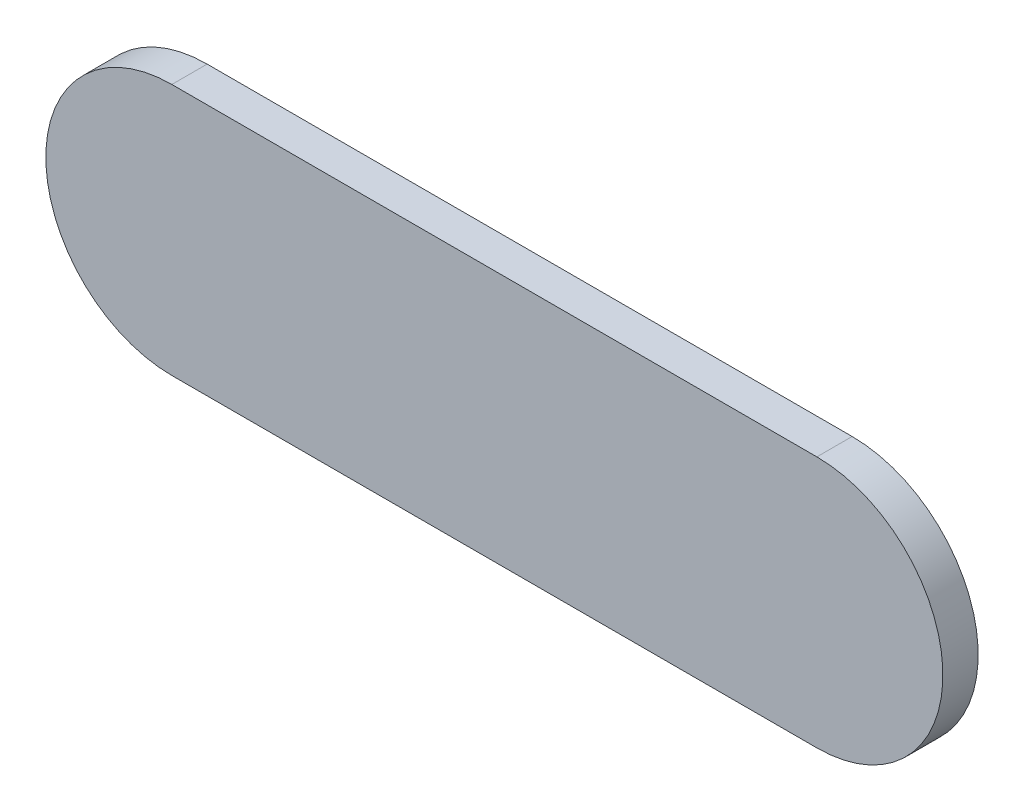
ISO-10303-21;
HEADER;
FILE_DESCRIPTION(('STEP AP214'),'2;1');
FILE_NAME('part.step','',(''),(''),'','','');
FILE_SCHEMA(('AUTOMOTIVE_DESIGN { 1 0 10303 214 1 1 1 1 }'));
ENDSEC;
DATA;
#1=APPLICATION_CONTEXT('core data for automotive mechanical design processes');
#2=APPLICATION_PROTOCOL_DEFINITION('international standard','automotive_design',2000,#1);
#3=PRODUCT_CONTEXT('',#1,'mechanical');
#4=PRODUCT('Part','Part','',(#3));
#5=PRODUCT_RELATED_PRODUCT_CATEGORY('part','',(#4));
#6=PRODUCT_DEFINITION_FORMATION('','',#4);
#7=PRODUCT_DEFINITION_CONTEXT('part definition',#1,'design');
#8=PRODUCT_DEFINITION('design','',#6,#7);
#9=PRODUCT_DEFINITION_SHAPE('','',#8);
#10=(LENGTH_UNIT() NAMED_UNIT(*) SI_UNIT(.MILLI.,.METRE.));
#11=(NAMED_UNIT(*) PLANE_ANGLE_UNIT() SI_UNIT($,.RADIAN.));
#12=(NAMED_UNIT(*) SI_UNIT($,.STERADIAN.) SOLID_ANGLE_UNIT());
#13=UNCERTAINTY_MEASURE_WITH_UNIT(LENGTH_MEASURE(1.E-05),#10,'distance_accuracy_value','');
#14=(GEOMETRIC_REPRESENTATION_CONTEXT(3) GLOBAL_UNCERTAINTY_ASSIGNED_CONTEXT((#13)) GLOBAL_UNIT_ASSIGNED_CONTEXT((#10,
#11,#12)) REPRESENTATION_CONTEXT('',''));
#15=CARTESIAN_POINT('',(0.,0.,0.));
#16=DIRECTION('',(0.,0.,1.));
#17=DIRECTION('',(1.,0.,0.));
#18=AXIS2_PLACEMENT_3D('',#15,#16,#17);
#19=CARTESIAN_POINT('',(99.3169972,84.0599538,0.));
#20=DIRECTION('',(0.,1.,0.));
#21=DIRECTION('',(1.,0.,0.));
#22=AXIS2_PLACEMENT_3D('',#19,#20,#21);
#23=PLANE('',#22);
#24=DIRECTION('',(1.,0.,0.));
#25=VECTOR('',#24,1.);
#26=CARTESIAN_POINT('',(99.3169972,84.0599538,0.03556));
#27=LINE('',#26,#25);
#28=CARTESIAN_POINT('',(99.3169972,84.0599538,0.03556));
#29=VERTEX_POINT('',#28);
#30=CARTESIAN_POINT('',(99.9669832,84.0599538,0.03556));
#31=VERTEX_POINT('',#30);
#32=EDGE_CURVE('E11',#29,#31,#27,.T.);
#33=ORIENTED_EDGE('',*,*,#32,.F.);
#34=DIRECTION('',(0.,0.,1.));
#35=VECTOR('',#34,1.);
#36=CARTESIAN_POINT('',(99.3169972,84.0599538,0.));
#37=LINE('',#36,#35);
#38=CARTESIAN_POINT('',(99.3169972,84.0599538,0.));
#39=VERTEX_POINT('',#38);
#40=EDGE_CURVE('E24',#39,#29,#37,.T.);
#41=ORIENTED_EDGE('',*,*,#40,.F.);
#42=DIRECTION('',(1.,0.,0.));
#43=VECTOR('',#42,1.);
#44=CARTESIAN_POINT('',(99.3169972,84.0599538,0.));
#45=LINE('',#44,#43);
#46=CARTESIAN_POINT('',(99.9669832,84.0599538,0.));
#47=VERTEX_POINT('',#46);
#48=EDGE_CURVE('E75',#39,#47,#45,.T.);
#49=ORIENTED_EDGE('',*,*,#48,.T.);
#50=DIRECTION('',(0.,0.,1.));
#51=VECTOR('',#50,1.);
#52=CARTESIAN_POINT('',(99.9669832,84.0599538,0.));
#53=LINE('',#52,#51);
#54=EDGE_CURVE('E37',#47,#31,#53,.T.);
#55=ORIENTED_EDGE('',*,*,#54,.T.);
#56=EDGE_LOOP('',(#33,#41,#49,#55));
#57=FACE_BOUND('',#56,.T.);
#58=ADVANCED_FACE('F17',(#57),#23,.F.);
#59=CARTESIAN_POINT('',(99.9669832,84.1869538,0.));
#60=DIRECTION('',(0.,0.,-1.));
#61=DIRECTION('',(0.,-1.,0.));
#62=AXIS2_PLACEMENT_3D('',#59,#60,#61);
#63=CYLINDRICAL_SURFACE('',#62,0.127000000000005);
#64=CARTESIAN_POINT('',(99.9669832,84.1869538,0.03556));
#65=DIRECTION('',(0.,0.,1.));
#66=DIRECTION('',(0.,-1.,0.));
#67=AXIS2_PLACEMENT_3D('',#64,#65,#66);
#68=CIRCLE('',#67,0.127000000000005);
#69=CARTESIAN_POINT('',(99.9669832,84.3139538,0.03556));
#70=VERTEX_POINT('',#69);
#71=EDGE_CURVE('E83',#31,#70,#68,.T.);
#72=ORIENTED_EDGE('',*,*,#71,.F.);
#73=ORIENTED_EDGE('',*,*,#54,.F.);
#74=CARTESIAN_POINT('',(99.9669832,84.1869538,0.));
#75=DIRECTION('',(0.,0.,1.));
#76=DIRECTION('',(0.,-1.,0.));
#77=AXIS2_PLACEMENT_3D('',#74,#75,#76);
#78=CIRCLE('',#77,0.127000000000005);
#79=CARTESIAN_POINT('',(99.9669832,84.3139538,0.));
#80=VERTEX_POINT('',#79);
#81=EDGE_CURVE('E81',#47,#80,#78,.T.);
#82=ORIENTED_EDGE('',*,*,#81,.T.);
#83=DIRECTION('',(0.,0.,1.));
#84=VECTOR('',#83,1.);
#85=CARTESIAN_POINT('',(99.9669832,84.3139538,0.));
#86=LINE('',#85,#84);
#87=EDGE_CURVE('E67',#80,#70,#86,.T.);
#88=ORIENTED_EDGE('',*,*,#87,.T.);
#89=EDGE_LOOP('',(#72,#73,#82,#88));
#90=FACE_BOUND('',#89,.T.);
#91=ADVANCED_FACE('F89',(#90),#63,.T.);
#92=CARTESIAN_POINT('',(99.9669832,84.3139538,0.));
#93=DIRECTION('',(0.,-1.,0.));
#94=DIRECTION('',(-1.,0.,0.));
#95=AXIS2_PLACEMENT_3D('',#92,#93,#94);
#96=PLANE('',#95);
#97=DIRECTION('',(-1.,0.,0.));
#98=VECTOR('',#97,1.);
#99=CARTESIAN_POINT('',(99.9669832,84.3139538,0.03556));
#100=LINE('',#99,#98);
#101=CARTESIAN_POINT('',(99.3169972,84.3139538,0.03556));
#102=VERTEX_POINT('',#101);
#103=EDGE_CURVE('E71',#70,#102,#100,.T.);
#104=ORIENTED_EDGE('',*,*,#103,.F.);
#105=ORIENTED_EDGE('',*,*,#87,.F.);
#106=DIRECTION('',(-1.,0.,0.));
#107=VECTOR('',#106,1.);
#108=CARTESIAN_POINT('',(99.9669832,84.3139538,0.));
#109=LINE('',#108,#107);
#110=CARTESIAN_POINT('',(99.3169972,84.3139538,0.));
#111=VERTEX_POINT('',#110);
#112=EDGE_CURVE('E63',#80,#111,#109,.T.);
#113=ORIENTED_EDGE('',*,*,#112,.T.);
#114=DIRECTION('',(0.,0.,1.));
#115=VECTOR('',#114,1.);
#116=CARTESIAN_POINT('',(99.3169972,84.3139538,0.));
#117=LINE('',#116,#115);
#118=EDGE_CURVE('E53',#111,#102,#117,.T.);
#119=ORIENTED_EDGE('',*,*,#118,.T.);
#120=EDGE_LOOP('',(#104,#105,#113,#119));
#121=FACE_BOUND('',#120,.T.);
#122=ADVANCED_FACE('F66',(#121),#96,.F.);
#123=CARTESIAN_POINT('',(99.3169972,84.1869538,0.));
#124=DIRECTION('',(0.,0.,-1.));
#125=DIRECTION('',(-1.11896493820492E-13,1.,0.));
#126=AXIS2_PLACEMENT_3D('',#123,#124,#125);
#127=CYLINDRICAL_SURFACE('',#126,0.127000000000005);
#128=CARTESIAN_POINT('',(99.3169972,84.1869538,0.03556));
#129=DIRECTION('',(0.,0.,1.));
#130=DIRECTION('',(-1.11896493820492E-13,1.,0.));
#131=AXIS2_PLACEMENT_3D('',#128,#129,#130);
#132=CIRCLE('',#131,0.127000000000005);
#133=EDGE_CURVE('E59',#102,#29,#132,.T.);
#134=ORIENTED_EDGE('',*,*,#133,.F.);
#135=ORIENTED_EDGE('',*,*,#118,.F.);
#136=CARTESIAN_POINT('',(99.3169972,84.1869538,0.));
#137=DIRECTION('',(0.,0.,1.));
#138=DIRECTION('',(-1.11896493820492E-13,1.,0.));
#139=AXIS2_PLACEMENT_3D('',#136,#137,#138);
#140=CIRCLE('',#139,0.127000000000005);
#141=EDGE_CURVE('E57',#111,#39,#140,.T.);
#142=ORIENTED_EDGE('',*,*,#141,.T.);
#143=ORIENTED_EDGE('',*,*,#40,.T.);
#144=EDGE_LOOP('',(#134,#135,#142,#143));
#145=FACE_BOUND('',#144,.T.);
#146=ADVANCED_FACE('F55',(#145),#127,.T.);
#147=CARTESIAN_POINT('',(99.3169972,84.0599538,0.));
#148=DIRECTION('',(0.,0.,-1.));
#149=DIRECTION('',(-1.,0.,0.));
#150=AXIS2_PLACEMENT_3D('',#147,#148,#149);
#151=PLANE('',#150);
#152=ORIENTED_EDGE('',*,*,#141,.F.);
#153=ORIENTED_EDGE('',*,*,#112,.F.);
#154=ORIENTED_EDGE('',*,*,#81,.F.);
#155=ORIENTED_EDGE('',*,*,#48,.F.);
#156=EDGE_LOOP('',(#152,#153,#154,#155));
#157=FACE_BOUND('',#156,.T.);
#158=ADVANCED_FACE('F74',(#157),#151,.T.);
#159=CARTESIAN_POINT('',(99.3169972,84.0599538,0.03556));
#160=DIRECTION('',(0.,0.,-1.));
#161=DIRECTION('',(-1.,0.,0.));
#162=AXIS2_PLACEMENT_3D('',#159,#160,#161);
#163=PLANE('',#162);
#164=ORIENTED_EDGE('',*,*,#32,.T.);
#165=ORIENTED_EDGE('',*,*,#71,.T.);
#166=ORIENTED_EDGE('',*,*,#103,.T.);
#167=ORIENTED_EDGE('',*,*,#133,.T.);
#168=EDGE_LOOP('',(#164,#165,#166,#167));
#169=FACE_BOUND('',#168,.T.);
#170=ADVANCED_FACE('F91',(#169),#163,.F.);
#171=CLOSED_SHELL('',(#58,#91,#122,#146,#158,#170));
#172=MANIFOLD_SOLID_BREP('B1',#171);
#173=ADVANCED_BREP_SHAPE_REPRESENTATION('',(#18,#172),#14);
#174=SHAPE_DEFINITION_REPRESENTATION(#9,#173);
ENDSEC;
END-ISO-10303-21;
